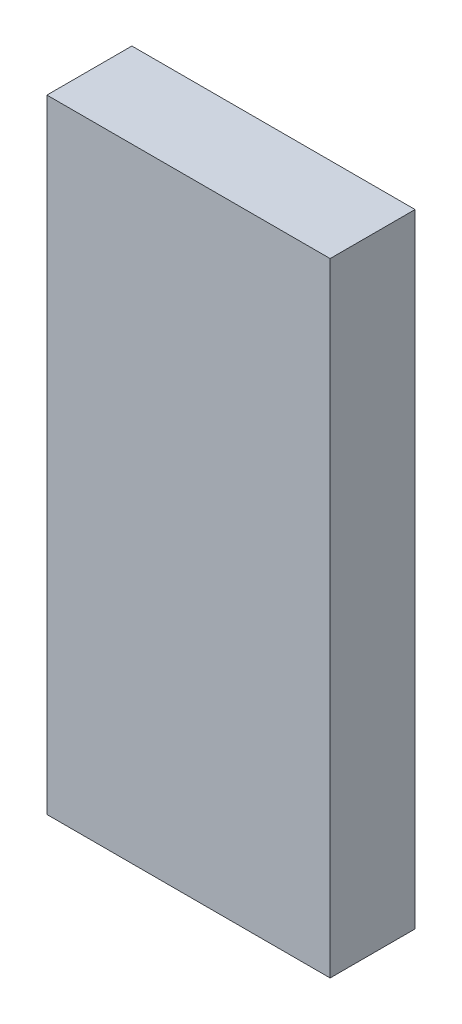
ISO-10303-21;
HEADER;
FILE_DESCRIPTION(('STEP AP214'),'2;1');
FILE_NAME('part.step','',(''),(''),'','','');
FILE_SCHEMA(('AUTOMOTIVE_DESIGN { 1 0 10303 214 1 1 1 1 }'));
ENDSEC;
DATA;
#1=APPLICATION_CONTEXT('core data for automotive mechanical design processes');
#2=APPLICATION_PROTOCOL_DEFINITION('international standard','automotive_design',2000,#1);
#3=PRODUCT_CONTEXT('',#1,'mechanical');
#4=PRODUCT('Part','Part','',(#3));
#5=PRODUCT_RELATED_PRODUCT_CATEGORY('part','',(#4));
#6=PRODUCT_DEFINITION_FORMATION('','',#4);
#7=PRODUCT_DEFINITION_CONTEXT('part definition',#1,'design');
#8=PRODUCT_DEFINITION('design','',#6,#7);
#9=PRODUCT_DEFINITION_SHAPE('','',#8);
#10=(LENGTH_UNIT() NAMED_UNIT(*) SI_UNIT(.MILLI.,.METRE.));
#11=(NAMED_UNIT(*) PLANE_ANGLE_UNIT() SI_UNIT($,.RADIAN.));
#12=(NAMED_UNIT(*) SI_UNIT($,.STERADIAN.) SOLID_ANGLE_UNIT());
#13=UNCERTAINTY_MEASURE_WITH_UNIT(LENGTH_MEASURE(1.E-05),#10,'distance_accuracy_value','');
#14=(GEOMETRIC_REPRESENTATION_CONTEXT(3) GLOBAL_UNCERTAINTY_ASSIGNED_CONTEXT((#13)) GLOBAL_UNIT_ASSIGNED_CONTEXT((#10,
#11,#12)) REPRESENTATION_CONTEXT('',''));
#15=CARTESIAN_POINT('',(0.,0.,0.));
#16=DIRECTION('',(0.,0.,1.));
#17=DIRECTION('',(1.,0.,0.));
#18=AXIS2_PLACEMENT_3D('',#15,#16,#17);
#19=CARTESIAN_POINT('',(2.,-1.1,0.3));
#20=DIRECTION('',(0.,0.,1.));
#21=DIRECTION('',(1.,0.,0.));
#22=AXIS2_PLACEMENT_3D('',#19,#20,#21);
#23=PLANE('',#22);
#24=DIRECTION('',(1.,0.,0.));
#25=VECTOR('',#24,1.);
#26=CARTESIAN_POINT('',(2.,-1.1,0.3));
#27=LINE('',#26,#25);
#28=CARTESIAN_POINT('',(1.,-1.1,0.3));
#29=VERTEX_POINT('',#28);
#30=CARTESIAN_POINT('',(2.,-1.1,0.3));
#31=VERTEX_POINT('',#30);
#32=EDGE_CURVE('E55',#29,#31,#27,.T.);
#33=ORIENTED_EDGE('',*,*,#32,.T.);
#34=DIRECTION('',(0.,1.,0.));
#35=VECTOR('',#34,1.);
#36=CARTESIAN_POINT('',(2.,-1.1,0.3));
#37=LINE('',#36,#35);
#38=CARTESIAN_POINT('',(2.,1.1,0.3));
#39=VERTEX_POINT('',#38);
#40=EDGE_CURVE('E75',#31,#39,#37,.T.);
#41=ORIENTED_EDGE('',*,*,#40,.T.);
#42=DIRECTION('',(1.,0.,0.));
#43=VECTOR('',#42,1.);
#44=CARTESIAN_POINT('',(2.,1.1,0.3));
#45=LINE('',#44,#43);
#46=CARTESIAN_POINT('',(1.,1.1,0.3));
#47=VERTEX_POINT('',#46);
#48=EDGE_CURVE('E20',#39,#47,#45,.F.);
#49=ORIENTED_EDGE('',*,*,#48,.T.);
#50=DIRECTION('',(0.,1.,0.));
#51=VECTOR('',#50,1.);
#52=CARTESIAN_POINT('',(1.,-1.1,0.3));
#53=LINE('',#52,#51);
#54=EDGE_CURVE('E65',#29,#47,#53,.T.);
#55=ORIENTED_EDGE('',*,*,#54,.F.);
#56=EDGE_LOOP('',(#33,#41,#49,#55));
#57=FACE_BOUND('',#56,.T.);
#58=ADVANCED_FACE('F17',(#57),#23,.T.);
#59=CARTESIAN_POINT('',(1.,-1.1,0.));
#60=DIRECTION('',(-1.,0.,0.));
#61=DIRECTION('',(0.,0.,1.));
#62=AXIS2_PLACEMENT_3D('',#59,#60,#61);
#63=PLANE('',#62);
#64=DIRECTION('',(0.,1.,0.));
#65=VECTOR('',#64,1.);
#66=CARTESIAN_POINT('',(1.,-1.1,0.));
#67=LINE('',#66,#65);
#68=CARTESIAN_POINT('',(1.,1.1,0.));
#69=VERTEX_POINT('',#68);
#70=CARTESIAN_POINT('',(1.,-1.1,0.));
#71=VERTEX_POINT('',#70);
#72=EDGE_CURVE('E73',#69,#71,#67,.F.);
#73=ORIENTED_EDGE('',*,*,#72,.T.);
#74=DIRECTION('',(0.,0.,1.));
#75=VECTOR('',#74,1.);
#76=CARTESIAN_POINT('',(1.,-1.1,0.));
#77=LINE('',#76,#75);
#78=EDGE_CURVE('E62',#71,#29,#77,.T.);
#79=ORIENTED_EDGE('',*,*,#78,.T.);
#80=ORIENTED_EDGE('',*,*,#54,.T.);
#81=DIRECTION('',(0.,0.,1.));
#82=VECTOR('',#81,1.);
#83=CARTESIAN_POINT('',(1.,1.1,0.));
#84=LINE('',#83,#82);
#85=EDGE_CURVE('E79',#69,#47,#84,.T.);
#86=ORIENTED_EDGE('',*,*,#85,.F.);
#87=EDGE_LOOP('',(#73,#79,#80,#86));
#88=FACE_BOUND('',#87,.T.);
#89=ADVANCED_FACE('F72',(#88),#63,.T.);
#90=CARTESIAN_POINT('',(2.,-1.1,0.));
#91=DIRECTION('',(0.,1.,0.));
#92=DIRECTION('',(0.,0.,1.));
#93=AXIS2_PLACEMENT_3D('',#90,#91,#92);
#94=PLANE('',#93);
#95=DIRECTION('',(1.,0.,0.));
#96=VECTOR('',#95,1.);
#97=CARTESIAN_POINT('',(2.,-1.1,0.));
#98=LINE('',#97,#96);
#99=CARTESIAN_POINT('',(2.,-1.1,0.));
#100=VERTEX_POINT('',#99);
#101=EDGE_CURVE('E83',#71,#100,#98,.T.);
#102=ORIENTED_EDGE('',*,*,#101,.T.);
#103=DIRECTION('',(0.,0.,1.));
#104=VECTOR('',#103,1.);
#105=CARTESIAN_POINT('',(2.,-1.1,0.));
#106=LINE('',#105,#104);
#107=EDGE_CURVE('E64',#100,#31,#106,.T.);
#108=ORIENTED_EDGE('',*,*,#107,.T.);
#109=ORIENTED_EDGE('',*,*,#32,.F.);
#110=ORIENTED_EDGE('',*,*,#78,.F.);
#111=EDGE_LOOP('',(#102,#108,#109,#110));
#112=FACE_BOUND('',#111,.T.);
#113=ADVANCED_FACE('F60',(#112),#94,.F.);
#114=CARTESIAN_POINT('',(2.,-1.1,0.));
#115=DIRECTION('',(-1.,0.,0.));
#116=DIRECTION('',(0.,0.,1.));
#117=AXIS2_PLACEMENT_3D('',#114,#115,#116);
#118=PLANE('',#117);
#119=ORIENTED_EDGE('',*,*,#107,.F.);
#120=DIRECTION('',(0.,1.,0.));
#121=VECTOR('',#120,1.);
#122=CARTESIAN_POINT('',(2.,-1.1,0.));
#123=LINE('',#122,#121);
#124=CARTESIAN_POINT('',(2.,1.1,0.));
#125=VERTEX_POINT('',#124);
#126=EDGE_CURVE('E26',#100,#125,#123,.T.);
#127=ORIENTED_EDGE('',*,*,#126,.T.);
#128=DIRECTION('',(0.,0.,1.));
#129=VECTOR('',#128,1.);
#130=CARTESIAN_POINT('',(2.,1.1,0.));
#131=LINE('',#130,#129);
#132=EDGE_CURVE('E34',#39,#125,#131,.F.);
#133=ORIENTED_EDGE('',*,*,#132,.F.);
#134=ORIENTED_EDGE('',*,*,#40,.F.);
#135=EDGE_LOOP('',(#119,#127,#133,#134));
#136=FACE_BOUND('',#135,.T.);
#137=ADVANCED_FACE('F88',(#136),#118,.F.);
#138=CARTESIAN_POINT('',(2.,1.1,0.));
#139=DIRECTION('',(0.,1.,0.));
#140=DIRECTION('',(0.,0.,1.));
#141=AXIS2_PLACEMENT_3D('',#138,#139,#140);
#142=PLANE('',#141);
#143=ORIENTED_EDGE('',*,*,#132,.T.);
#144=DIRECTION('',(1.,0.,0.));
#145=VECTOR('',#144,1.);
#146=CARTESIAN_POINT('',(2.,1.1,0.));
#147=LINE('',#146,#145);
#148=EDGE_CURVE('E11',#125,#69,#147,.F.);
#149=ORIENTED_EDGE('',*,*,#148,.T.);
#150=ORIENTED_EDGE('',*,*,#85,.T.);
#151=ORIENTED_EDGE('',*,*,#48,.F.);
#152=EDGE_LOOP('',(#143,#149,#150,#151));
#153=FACE_BOUND('',#152,.T.);
#154=ADVANCED_FACE('F91',(#153),#142,.T.);
#155=CARTESIAN_POINT('',(2.,-1.1,0.));
#156=DIRECTION('',(0.,0.,1.));
#157=DIRECTION('',(1.,0.,0.));
#158=AXIS2_PLACEMENT_3D('',#155,#156,#157);
#159=PLANE('',#158);
#160=ORIENTED_EDGE('',*,*,#126,.F.);
#161=ORIENTED_EDGE('',*,*,#101,.F.);
#162=ORIENTED_EDGE('',*,*,#72,.F.);
#163=ORIENTED_EDGE('',*,*,#148,.F.);
#164=EDGE_LOOP('',(#160,#161,#162,#163));
#165=FACE_BOUND('',#164,.T.);
#166=ADVANCED_FACE('F90',(#165),#159,.F.);
#167=CLOSED_SHELL('',(#58,#89,#113,#137,#154,#166));
#168=MANIFOLD_SOLID_BREP('B1',#167);
#169=ADVANCED_BREP_SHAPE_REPRESENTATION('',(#18,#168),#14);
#170=SHAPE_DEFINITION_REPRESENTATION(#9,#169);
ENDSEC;
END-ISO-10303-21;
